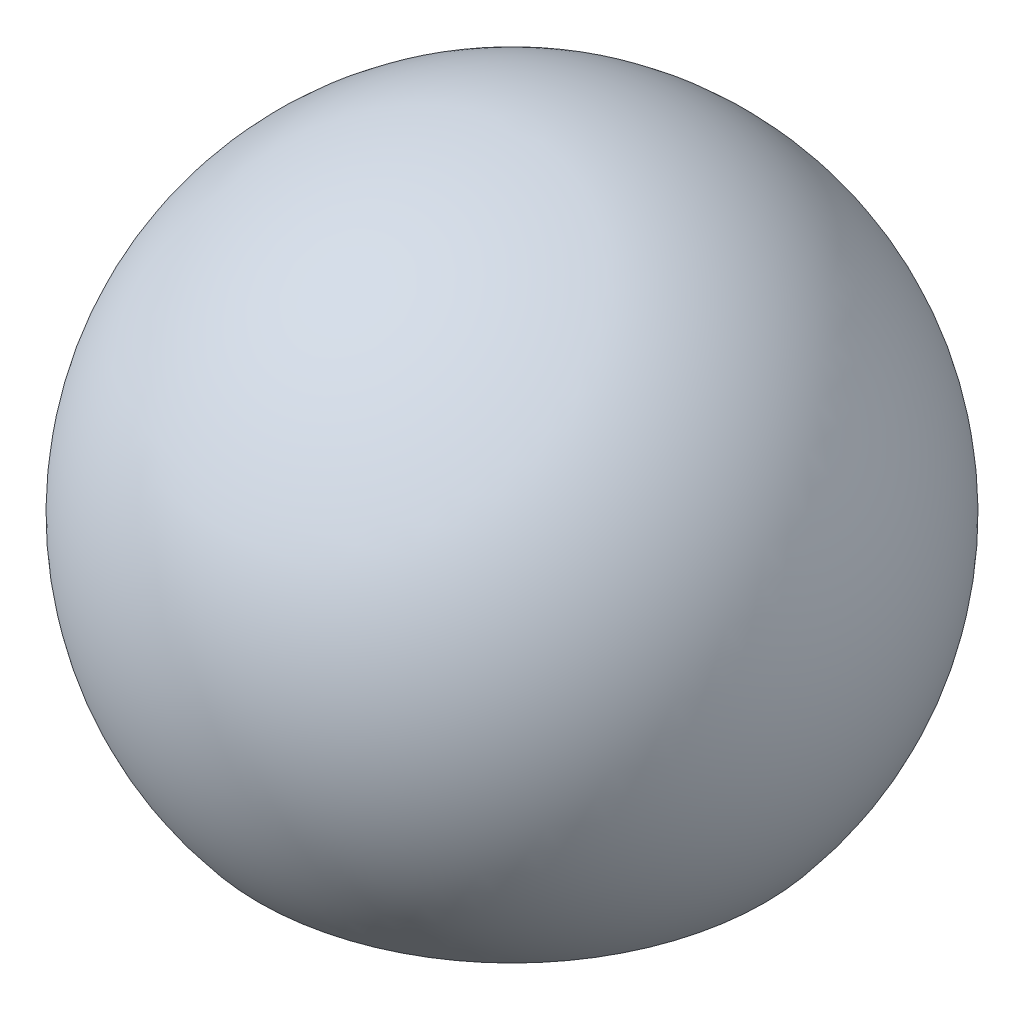
ISO-10303-21;
HEADER;
FILE_DESCRIPTION(('STEP AP214'),'2;1');
FILE_NAME('part.step','',(''),(''),'','','');
FILE_SCHEMA(('AUTOMOTIVE_DESIGN { 1 0 10303 214 1 1 1 1 }'));
ENDSEC;
DATA;
#1=APPLICATION_CONTEXT('core data for automotive mechanical design processes');
#2=APPLICATION_PROTOCOL_DEFINITION('international standard','automotive_design',2000,#1);
#3=PRODUCT_CONTEXT('',#1,'mechanical');
#4=PRODUCT('Part','Part','',(#3));
#5=PRODUCT_RELATED_PRODUCT_CATEGORY('part','',(#4));
#6=PRODUCT_DEFINITION_FORMATION('','',#4);
#7=PRODUCT_DEFINITION_CONTEXT('part definition',#1,'design');
#8=PRODUCT_DEFINITION('design','',#6,#7);
#9=PRODUCT_DEFINITION_SHAPE('','',#8);
#10=(LENGTH_UNIT() NAMED_UNIT(*) SI_UNIT(.MILLI.,.METRE.));
#11=(NAMED_UNIT(*) PLANE_ANGLE_UNIT() SI_UNIT($,.RADIAN.));
#12=(NAMED_UNIT(*) SI_UNIT($,.STERADIAN.) SOLID_ANGLE_UNIT());
#13=UNCERTAINTY_MEASURE_WITH_UNIT(LENGTH_MEASURE(1.E-05),#10,'distance_accuracy_value','');
#14=(GEOMETRIC_REPRESENTATION_CONTEXT(3) GLOBAL_UNCERTAINTY_ASSIGNED_CONTEXT((#13)) GLOBAL_UNIT_ASSIGNED_CONTEXT((#10,
#11,#12)) REPRESENTATION_CONTEXT('',''));
#15=CARTESIAN_POINT('',(0.,0.,0.));
#16=DIRECTION('',(0.,0.,1.));
#17=DIRECTION('',(1.,0.,0.));
#18=AXIS2_PLACEMENT_3D('',#15,#16,#17);
#19=CARTESIAN_POINT('',(0.,-83.4160517864829,0.));
#20=DIRECTION('',(0.,-1.,0.));
#21=DIRECTION('',(0.,0.,-1.));
#22=AXIS2_PLACEMENT_3D('',#19,#20,#21);
#23=PLANE('',#22);
#24=CARTESIAN_POINT('',(0.,-83.4160517864829,0.));
#25=DIRECTION('',(0.,1.,0.));
#26=DIRECTION('',(0.,0.,1.));
#27=AXIS2_PLACEMENT_3D('',#24,#25,#26);
#28=CIRCLE('',#27,100.);
#29=CARTESIAN_POINT('',(0.,-83.4160517864829,100.));
#30=VERTEX_POINT('',#29);
#31=EDGE_CURVE('E10',#30,#30,#28,.T.);
#32=ORIENTED_EDGE('',*,*,#31,.F.);
#33=EDGE_LOOP('',(#32));
#34=FACE_BOUND('',#33,.T.);
#35=ADVANCED_FACE('F41',(#34),#23,.T.);
#36=CARTESIAN_POINT('',(0.,0.,0.));
#37=DIRECTION('',(0.,1.,0.));
#38=DIRECTION('',(1.,0.,0.));
#39=AXIS2_PLACEMENT_3D('',#36,#37,#38);
#40=SPHERICAL_SURFACE('',#39,130.223798499526);
#41=ORIENTED_EDGE('',*,*,#31,.T.);
#42=EDGE_LOOP('',(#41));
#43=FACE_BOUND('',#42,.T.);
#44=ADVANCED_FACE('F49',(#43),#40,.T.);
#45=CLOSED_SHELL('',(#35,#44));
#46=MANIFOLD_SOLID_BREP('B2',#45);
#47=ADVANCED_BREP_SHAPE_REPRESENTATION('',(#18,#46),#14);
#48=SHAPE_DEFINITION_REPRESENTATION(#9,#47);
ENDSEC;
END-ISO-10303-21;
